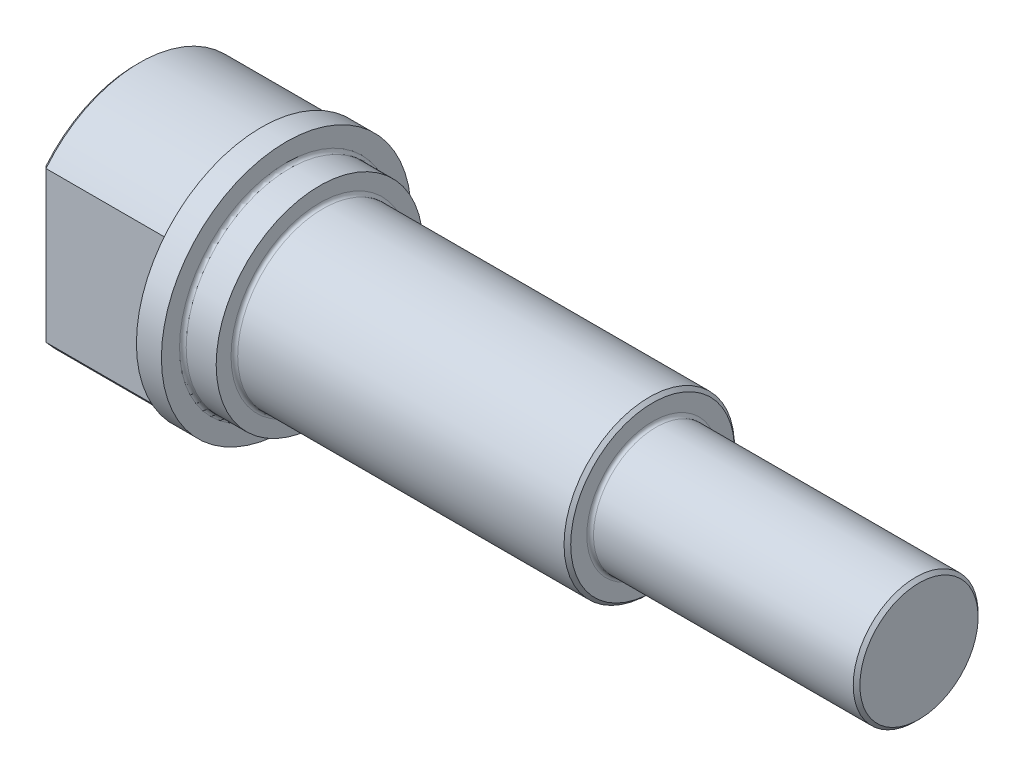
ISO-10303-21;
HEADER;
FILE_DESCRIPTION(('STEP AP214'),'2;1');
FILE_NAME('part.step','',(''),(''),'','','');
FILE_SCHEMA(('AUTOMOTIVE_DESIGN { 1 0 10303 214 1 1 1 1 }'));
ENDSEC;
DATA;
#1=APPLICATION_CONTEXT('core data for automotive mechanical design processes');
#2=APPLICATION_PROTOCOL_DEFINITION('international standard','automotive_design',2000,#1);
#3=PRODUCT_CONTEXT('',#1,'mechanical');
#4=PRODUCT('Part','Part','',(#3));
#5=PRODUCT_RELATED_PRODUCT_CATEGORY('part','',(#4));
#6=PRODUCT_DEFINITION_FORMATION('','',#4);
#7=PRODUCT_DEFINITION_CONTEXT('part definition',#1,'design');
#8=PRODUCT_DEFINITION('design','',#6,#7);
#9=PRODUCT_DEFINITION_SHAPE('','',#8);
#10=(LENGTH_UNIT() NAMED_UNIT(*) SI_UNIT(.MILLI.,.METRE.));
#11=(NAMED_UNIT(*) PLANE_ANGLE_UNIT() SI_UNIT($,.RADIAN.));
#12=(NAMED_UNIT(*) SI_UNIT($,.STERADIAN.) SOLID_ANGLE_UNIT());
#13=UNCERTAINTY_MEASURE_WITH_UNIT(LENGTH_MEASURE(1.E-05),#10,'distance_accuracy_value','');
#14=(GEOMETRIC_REPRESENTATION_CONTEXT(3) GLOBAL_UNCERTAINTY_ASSIGNED_CONTEXT((#13)) GLOBAL_UNIT_ASSIGNED_CONTEXT((#10,
#11,#12)) REPRESENTATION_CONTEXT('',''));
#15=CARTESIAN_POINT('',(0.,0.,0.));
#16=DIRECTION('',(0.,0.,1.));
#17=DIRECTION('',(1.,0.,0.));
#18=AXIS2_PLACEMENT_3D('',#15,#16,#17);
#19=CARTESIAN_POINT('',(0.,0.,0.));
#20=DIRECTION('',(-1.,0.,0.));
#21=DIRECTION('',(0.,0.,1.));
#22=AXIS2_PLACEMENT_3D('',#19,#20,#21);
#23=CYLINDRICAL_SURFACE('',#22,9.1694);
#24=DIRECTION('',(-1.,0.,0.));
#25=VECTOR('',#24,1.);
#26=CARTESIAN_POINT('',(21.1823340815986,5.74055453331819,7.1501));
#27=LINE('',#26,#25);
#28=CARTESIAN_POINT('',(9.271,5.74055453331819,7.1501));
#29=VERTEX_POINT('',#28);
#30=CARTESIAN_POINT('',(0.25399999999999,5.74055453331819,7.1501));
#31=VERTEX_POINT('',#30);
#32=EDGE_CURVE('E133',#29,#31,#27,.T.);
#33=ORIENTED_EDGE('',*,*,#32,.F.);
#34=CARTESIAN_POINT('',(9.271,0.,0.));
#35=DIRECTION('',(1.,0.,0.));
#36=DIRECTION('',(0.,0.,-1.));
#37=AXIS2_PLACEMENT_3D('',#34,#35,#36);
#38=CIRCLE('',#37,9.1694);
#39=CARTESIAN_POINT('',(9.271,5.74055453331819,-7.1501));
#40=VERTEX_POINT('',#39);
#41=EDGE_CURVE('E244',#29,#40,#38,.F.);
#42=ORIENTED_EDGE('',*,*,#41,.T.);
#43=DIRECTION('',(-1.,0.,0.));
#44=VECTOR('',#43,1.);
#45=CARTESIAN_POINT('',(21.1823340815986,5.74055453331819,-7.1501));
#46=LINE('',#45,#44);
#47=CARTESIAN_POINT('',(0.25399999999999,5.74055453331819,-7.1501));
#48=VERTEX_POINT('',#47);
#49=EDGE_CURVE('E220',#40,#48,#46,.T.);
#50=ORIENTED_EDGE('',*,*,#49,.T.);
#51=CARTESIAN_POINT('',(0.25399999999999,0.,0.));
#52=DIRECTION('',(1.,0.,0.));
#53=DIRECTION('',(0.,0.,-1.));
#54=AXIS2_PLACEMENT_3D('',#51,#52,#53);
#55=CIRCLE('',#54,9.1694);
#56=EDGE_CURVE('E165',#48,#31,#55,.T.);
#57=ORIENTED_EDGE('',*,*,#56,.T.);
#58=EDGE_LOOP('',(#33,#42,#50,#57));
#59=FACE_BOUND('',#58,.T.);
#60=ADVANCED_FACE('F48',(#59),#23,.T.);
#61=CARTESIAN_POINT('',(39.37,6.5,0.));
#62=DIRECTION('',(-1.,0.,0.));
#63=DIRECTION('',(0.,0.,1.));
#64=AXIS2_PLACEMENT_3D('',#61,#62,#63);
#65=PLANE('',#64);
#66=CARTESIAN_POINT('',(39.37,0.,0.));
#67=DIRECTION('',(-1.,0.,0.));
#68=DIRECTION('',(0.,0.,1.));
#69=AXIS2_PLACEMENT_3D('',#66,#67,#68);
#70=CIRCLE('',#69,5.0165);
#71=CARTESIAN_POINT('',(39.37,0.,5.0165));
#72=VERTEX_POINT('',#71);
#73=EDGE_CURVE('E237',#72,#72,#70,.T.);
#74=ORIENTED_EDGE('',*,*,#73,.T.);
#75=EDGE_LOOP('',(#74));
#76=FACE_BOUND('',#75,.T.);
#77=CARTESIAN_POINT('',(39.37,0.,0.));
#78=DIRECTION('',(-1.,0.,0.));
#79=DIRECTION('',(0.,0.,1.));
#80=AXIS2_PLACEMENT_3D('',#77,#78,#79);
#81=CIRCLE('',#80,6.24600000000001);
#82=CARTESIAN_POINT('',(39.37,0.,6.24600000000001));
#83=VERTEX_POINT('',#82);
#84=EDGE_CURVE('E171',#83,#83,#81,.F.);
#85=ORIENTED_EDGE('',*,*,#84,.T.);
#86=EDGE_LOOP('',(#85));
#87=FACE_BOUND('',#86,.T.);
#88=ADVANCED_FACE('F300',(#76,#87),#65,.F.);
#89=CARTESIAN_POINT('',(0.,0.,0.));
#90=DIRECTION('',(-1.,0.,0.));
#91=DIRECTION('',(0.,0.,1.));
#92=AXIS2_PLACEMENT_3D('',#89,#90,#91);
#93=CYLINDRICAL_SURFACE('',#92,6.5);
#94=CARTESIAN_POINT('',(14.224,0.,0.));
#95=DIRECTION('',(-1.,0.,0.));
#96=DIRECTION('',(0.,0.,1.));
#97=AXIS2_PLACEMENT_3D('',#94,#95,#96);
#98=CIRCLE('',#97,6.5);
#99=CARTESIAN_POINT('',(14.224,0.,6.5));
#100=VERTEX_POINT('',#99);
#101=EDGE_CURVE('E249',#100,#100,#98,.F.);
#102=ORIENTED_EDGE('',*,*,#101,.T.);
#103=EDGE_LOOP('',(#102));
#104=FACE_BOUND('',#103,.T.);
#105=CARTESIAN_POINT('',(39.116,0.,0.));
#106=DIRECTION('',(-1.,0.,0.));
#107=DIRECTION('',(0.,0.,1.));
#108=AXIS2_PLACEMENT_3D('',#105,#106,#107);
#109=CIRCLE('',#108,6.5);
#110=CARTESIAN_POINT('',(39.116,0.,6.5));
#111=VERTEX_POINT('',#110);
#112=EDGE_CURVE('E168',#111,#111,#109,.T.);
#113=ORIENTED_EDGE('',*,*,#112,.T.);
#114=EDGE_LOOP('',(#113));
#115=FACE_BOUND('',#114,.T.);
#116=ADVANCED_FACE('F307',(#104,#115),#93,.T.);
#117=CARTESIAN_POINT('',(13.97,7.8867,0.));
#118=DIRECTION('',(-1.,0.,0.));
#119=DIRECTION('',(0.,0.,1.));
#120=AXIS2_PLACEMENT_3D('',#117,#118,#119);
#121=PLANE('',#120);
#122=CARTESIAN_POINT('',(13.97,0.,0.));
#123=DIRECTION('',(-1.,0.,0.));
#124=DIRECTION('',(0.,0.,1.));
#125=AXIS2_PLACEMENT_3D('',#122,#123,#124);
#126=CIRCLE('',#125,6.754);
#127=CARTESIAN_POINT('',(13.97,0.,6.754));
#128=VERTEX_POINT('',#127);
#129=EDGE_CURVE('E246',#128,#128,#126,.T.);
#130=ORIENTED_EDGE('',*,*,#129,.T.);
#131=EDGE_LOOP('',(#130));
#132=FACE_BOUND('',#131,.T.);
#133=CARTESIAN_POINT('',(13.97,0.,0.));
#134=DIRECTION('',(-1.,0.,0.));
#135=DIRECTION('',(0.,0.,1.));
#136=AXIS2_PLACEMENT_3D('',#133,#134,#135);
#137=CIRCLE('',#136,7.8867);
#138=CARTESIAN_POINT('',(13.97,0.,7.8867));
#139=VERTEX_POINT('',#138);
#140=EDGE_CURVE('E144',#139,#139,#137,.T.);
#141=ORIENTED_EDGE('',*,*,#140,.F.);
#142=EDGE_LOOP('',(#141));
#143=FACE_BOUND('',#142,.T.);
#144=ADVANCED_FACE('F374',(#132,#143),#121,.F.);
#145=CARTESIAN_POINT('',(0.,0.,0.));
#146=DIRECTION('',(-1.,0.,0.));
#147=DIRECTION('',(0.,0.,1.));
#148=AXIS2_PLACEMENT_3D('',#145,#146,#147);
#149=CYLINDRICAL_SURFACE('',#148,7.8867);
#150=CARTESIAN_POINT('',(11.684,0.,0.));
#151=DIRECTION('',(-1.,0.,0.));
#152=DIRECTION('',(0.,0.,1.));
#153=AXIS2_PLACEMENT_3D('',#150,#151,#152);
#154=CIRCLE('',#153,7.8867);
#155=CARTESIAN_POINT('',(11.684,0.,7.8867));
#156=VERTEX_POINT('',#155);
#157=EDGE_CURVE('E13',#156,#156,#154,.F.);
#158=ORIENTED_EDGE('',*,*,#157,.T.);
#159=EDGE_LOOP('',(#158));
#160=FACE_BOUND('',#159,.T.);
#161=ORIENTED_EDGE('',*,*,#140,.T.);
#162=EDGE_LOOP('',(#161));
#163=FACE_BOUND('',#162,.T.);
#164=ADVANCED_FACE('F380',(#160,#163),#149,.T.);
#165=CARTESIAN_POINT('',(11.43,9.525,0.));
#166=DIRECTION('',(-1.,0.,0.));
#167=DIRECTION('',(0.,0.,1.));
#168=AXIS2_PLACEMENT_3D('',#165,#166,#167);
#169=PLANE('',#168);
#170=CARTESIAN_POINT('',(11.43,0.,0.));
#171=DIRECTION('',(-1.,0.,0.));
#172=DIRECTION('',(0.,0.,1.));
#173=AXIS2_PLACEMENT_3D('',#170,#171,#172);
#174=CIRCLE('',#173,8.1407);
#175=CARTESIAN_POINT('',(11.43,0.,8.1407));
#176=VERTEX_POINT('',#175);
#177=EDGE_CURVE('E62',#176,#176,#174,.T.);
#178=ORIENTED_EDGE('',*,*,#177,.T.);
#179=EDGE_LOOP('',(#178));
#180=FACE_BOUND('',#179,.T.);
#181=CARTESIAN_POINT('',(11.43,0.,0.));
#182=DIRECTION('',(-1.,0.,0.));
#183=DIRECTION('',(0.,0.,1.));
#184=AXIS2_PLACEMENT_3D('',#181,#182,#183);
#185=CIRCLE('',#184,9.525);
#186=CARTESIAN_POINT('',(11.43,0.,9.525));
#187=VERTEX_POINT('',#186);
#188=EDGE_CURVE('E136',#187,#187,#185,.T.);
#189=ORIENTED_EDGE('',*,*,#188,.F.);
#190=EDGE_LOOP('',(#189));
#191=FACE_BOUND('',#190,.T.);
#192=ADVANCED_FACE('F386',(#180,#191),#169,.F.);
#193=CARTESIAN_POINT('',(0.,0.,0.));
#194=DIRECTION('',(-1.,0.,0.));
#195=DIRECTION('',(0.,0.,1.));
#196=AXIS2_PLACEMENT_3D('',#193,#194,#195);
#197=CYLINDRICAL_SURFACE('',#196,9.525);
#198=CARTESIAN_POINT('',(9.525,0.,0.));
#199=DIRECTION('',(-1.,0.,0.));
#200=DIRECTION('',(0.,0.,1.));
#201=AXIS2_PLACEMENT_3D('',#198,#199,#200);
#202=CIRCLE('',#201,9.525);
#203=CARTESIAN_POINT('',(9.525,0.,9.525));
#204=VERTEX_POINT('',#203);
#205=EDGE_CURVE('E132',#204,#204,#202,.T.);
#206=ORIENTED_EDGE('',*,*,#205,.F.);
#207=EDGE_LOOP('',(#206));
#208=FACE_BOUND('',#207,.T.);
#209=ORIENTED_EDGE('',*,*,#188,.T.);
#210=EDGE_LOOP('',(#209));
#211=FACE_BOUND('',#210,.T.);
#212=ADVANCED_FACE('F318',(#208,#211),#197,.T.);
#213=CARTESIAN_POINT('',(9.525,9.1694,0.));
#214=DIRECTION('',(1.,0.,0.));
#215=DIRECTION('',(0.,0.,-1.));
#216=AXIS2_PLACEMENT_3D('',#213,#214,#215);
#217=PLANE('',#216);
#218=DIRECTION('',(0.,-1.,0.));
#219=VECTOR('',#218,1.);
#220=CARTESIAN_POINT('',(9.525,-5.74055453331819,7.4041));
#221=LINE('',#220,#219);
#222=CARTESIAN_POINT('',(9.525,5.82921699287306,7.4041));
#223=VERTEX_POINT('',#222);
#224=CARTESIAN_POINT('',(9.525,-5.82921699287306,7.4041));
#225=VERTEX_POINT('',#224);
#226=EDGE_CURVE('E226',#223,#225,#221,.T.);
#227=ORIENTED_EDGE('',*,*,#226,.T.);
#228=CARTESIAN_POINT('',(9.525,0.,0.));
#229=DIRECTION('',(1.,0.,0.));
#230=DIRECTION('',(0.,0.,-1.));
#231=AXIS2_PLACEMENT_3D('',#228,#229,#230);
#232=CIRCLE('',#231,9.4234);
#233=CARTESIAN_POINT('',(9.525,-5.82921699287306,-7.4041));
#234=VERTEX_POINT('',#233);
#235=EDGE_CURVE('E231',#225,#234,#232,.T.);
#236=ORIENTED_EDGE('',*,*,#235,.T.);
#237=DIRECTION('',(0.,1.,0.));
#238=VECTOR('',#237,1.);
#239=CARTESIAN_POINT('',(9.525,5.74055453331819,-7.4041));
#240=LINE('',#239,#238);
#241=CARTESIAN_POINT('',(9.525,5.82921699287306,-7.4041));
#242=VERTEX_POINT('',#241);
#243=EDGE_CURVE('E228',#234,#242,#240,.T.);
#244=ORIENTED_EDGE('',*,*,#243,.T.);
#245=CARTESIAN_POINT('',(9.525,0.,0.));
#246=DIRECTION('',(1.,0.,0.));
#247=DIRECTION('',(0.,0.,-1.));
#248=AXIS2_PLACEMENT_3D('',#245,#246,#247);
#249=CIRCLE('',#248,9.4234);
#250=EDGE_CURVE('E180',#242,#223,#249,.T.);
#251=ORIENTED_EDGE('',*,*,#250,.T.);
#252=EDGE_LOOP('',(#227,#236,#244,#251));
#253=FACE_BOUND('',#252,.T.);
#254=ORIENTED_EDGE('',*,*,#205,.T.);
#255=EDGE_LOOP('',(#254));
#256=FACE_BOUND('',#255,.T.);
#257=ADVANCED_FACE('F312',(#253,#256),#217,.F.);
#258=DIRECTION('',(-1.,0.,0.));
#259=VECTOR('',#258,1.);
#260=CARTESIAN_POINT('',(21.1823340815986,-5.74055453331819,-7.1501));
#261=LINE('',#260,#259);
#262=CARTESIAN_POINT('',(9.271,-5.74055453331819,-7.1501));
#263=VERTEX_POINT('',#262);
#264=CARTESIAN_POINT('',(0.25399999999999,-5.74055453331819,-7.1501));
#265=VERTEX_POINT('',#264);
#266=EDGE_CURVE('E320',#263,#265,#261,.T.);
#267=ORIENTED_EDGE('',*,*,#266,.F.);
#268=CARTESIAN_POINT('',(9.271,0.,0.));
#269=DIRECTION('',(1.,0.,0.));
#270=DIRECTION('',(0.,0.,-1.));
#271=AXIS2_PLACEMENT_3D('',#268,#269,#270);
#272=CIRCLE('',#271,9.1694);
#273=CARTESIAN_POINT('',(9.271,-5.74055453331819,7.1501));
#274=VERTEX_POINT('',#273);
#275=EDGE_CURVE('E70',#263,#274,#272,.F.);
#276=ORIENTED_EDGE('',*,*,#275,.T.);
#277=DIRECTION('',(-1.,0.,0.));
#278=VECTOR('',#277,1.);
#279=CARTESIAN_POINT('',(21.1823340815986,-5.74055453331819,7.1501));
#280=LINE('',#279,#278);
#281=CARTESIAN_POINT('',(0.25399999999999,-5.74055453331819,7.1501));
#282=VERTEX_POINT('',#281);
#283=EDGE_CURVE('E138',#274,#282,#280,.T.);
#284=ORIENTED_EDGE('',*,*,#283,.T.);
#285=CARTESIAN_POINT('',(0.25399999999999,0.,0.));
#286=DIRECTION('',(1.,0.,0.));
#287=DIRECTION('',(0.,0.,-1.));
#288=AXIS2_PLACEMENT_3D('',#285,#286,#287);
#289=CIRCLE('',#288,9.1694);
#290=EDGE_CURVE('E159',#282,#265,#289,.T.);
#291=ORIENTED_EDGE('',*,*,#290,.T.);
#292=EDGE_LOOP('',(#267,#276,#284,#291));
#293=FACE_BOUND('',#292,.T.);
#294=ADVANCED_FACE('F303',(#293),#23,.T.);
#295=CARTESIAN_POINT('',(0.,1.09985226280624,0.));
#296=DIRECTION('',(1.,0.,0.));
#297=DIRECTION('',(0.,0.,-1.));
#298=AXIS2_PLACEMENT_3D('',#295,#296,#297);
#299=PLANE('',#298);
#300=CARTESIAN_POINT('',(0.,0.,0.));
#301=DIRECTION('',(1.,0.,0.));
#302=DIRECTION('',(0.,0.,-1.));
#303=AXIS2_PLACEMENT_3D('',#300,#301,#302);
#304=CIRCLE('',#303,8.91540000000001);
#305=CARTESIAN_POINT('',(0.,5.65050103530652,6.89610000000001));
#306=VERTEX_POINT('',#305);
#307=CARTESIAN_POINT('',(0.,5.65050103530652,-6.89610000000001));
#308=VERTEX_POINT('',#307);
#309=EDGE_CURVE('E150',#306,#308,#304,.F.);
#310=ORIENTED_EDGE('',*,*,#309,.T.);
#311=DIRECTION('',(0.,-1.,0.));
#312=VECTOR('',#311,1.);
#313=CARTESIAN_POINT('',(0.,1.09985226280624,-6.89610000000001));
#314=LINE('',#313,#312);
#315=CARTESIAN_POINT('',(0.,-5.65050103530652,-6.89610000000001));
#316=VERTEX_POINT('',#315);
#317=EDGE_CURVE('E156',#308,#316,#314,.T.);
#318=ORIENTED_EDGE('',*,*,#317,.T.);
#319=CARTESIAN_POINT('',(0.,0.,0.));
#320=DIRECTION('',(1.,0.,0.));
#321=DIRECTION('',(0.,0.,-1.));
#322=AXIS2_PLACEMENT_3D('',#319,#320,#321);
#323=CIRCLE('',#322,8.91540000000001);
#324=CARTESIAN_POINT('',(0.,-5.65050103530652,6.89610000000001));
#325=VERTEX_POINT('',#324);
#326=EDGE_CURVE('E154',#316,#325,#323,.F.);
#327=ORIENTED_EDGE('',*,*,#326,.T.);
#328=DIRECTION('',(0.,1.,0.));
#329=VECTOR('',#328,1.);
#330=CARTESIAN_POINT('',(0.,1.09985226280624,6.89610000000001));
#331=LINE('',#330,#329);
#332=EDGE_CURVE('E152',#325,#306,#331,.T.);
#333=ORIENTED_EDGE('',*,*,#332,.T.);
#334=EDGE_LOOP('',(#310,#318,#327,#333));
#335=FACE_BOUND('',#334,.T.);
#336=CARTESIAN_POINT('',(0.,0.,0.));
#337=DIRECTION('',(-1.,0.,0.));
#338=DIRECTION('',(0.,0.,1.));
#339=AXIS2_PLACEMENT_3D('',#336,#337,#338);
#340=CIRCLE('',#339,1.09985226280624);
#341=CARTESIAN_POINT('',(0.,0.,1.09985226280624));
#342=VERTEX_POINT('',#341);
#343=EDGE_CURVE('E130',#342,#342,#340,.T.);
#344=ORIENTED_EDGE('',*,*,#343,.F.);
#345=EDGE_LOOP('',(#344));
#346=FACE_BOUND('',#345,.T.);
#347=ADVANCED_FACE('F126',(#335,#346),#299,.F.);
#348=CARTESIAN_POINT('',(0.,0.,0.));
#349=DIRECTION('',(-1.,0.,0.));
#350=DIRECTION('',(0.,0.,1.));
#351=AXIS2_PLACEMENT_3D('',#348,#349,#350);
#352=CONICAL_SURFACE('',#351,1.09985226280624,1.0471975511966);
#353=CARTESIAN_POINT('',(0.635,0.,0.));
#354=VERTEX_POINT('',#353);
#355=VERTEX_LOOP('',#354);
#356=FACE_BOUND('',#355,.T.);
#357=ORIENTED_EDGE('',*,*,#343,.T.);
#358=EDGE_LOOP('',(#357));
#359=FACE_BOUND('',#358,.T.);
#360=ADVANCED_FACE('F122',(#356,#359),#352,.F.);
#361=CARTESIAN_POINT('',(59.69,4.7625,0.));
#362=DIRECTION('',(-1.,0.,0.));
#363=DIRECTION('',(0.,0.,1.));
#364=AXIS2_PLACEMENT_3D('',#361,#362,#363);
#365=PLANE('',#364);
#366=CARTESIAN_POINT('',(59.69,0.,0.));
#367=DIRECTION('',(-1.,0.,0.));
#368=DIRECTION('',(0.,0.,1.));
#369=AXIS2_PLACEMENT_3D('',#366,#367,#368);
#370=CIRCLE('',#369,4.50850000000001);
#371=CARTESIAN_POINT('',(59.69,0.,4.50850000000001));
#372=VERTEX_POINT('',#371);
#373=EDGE_CURVE('E177',#372,#372,#370,.F.);
#374=ORIENTED_EDGE('',*,*,#373,.T.);
#375=EDGE_LOOP('',(#374));
#376=FACE_BOUND('',#375,.T.);
#377=ADVANCED_FACE('F125',(#376),#365,.F.);
#378=CARTESIAN_POINT('',(0.,0.,0.));
#379=DIRECTION('',(-1.,0.,0.));
#380=DIRECTION('',(0.,0.,1.));
#381=AXIS2_PLACEMENT_3D('',#378,#379,#380);
#382=CYLINDRICAL_SURFACE('',#381,4.7625);
#383=CARTESIAN_POINT('',(39.624,0.,0.));
#384=DIRECTION('',(-1.,0.,0.));
#385=DIRECTION('',(0.,0.,1.));
#386=AXIS2_PLACEMENT_3D('',#383,#384,#385);
#387=CIRCLE('',#386,4.7625);
#388=CARTESIAN_POINT('',(39.624,0.,4.7625));
#389=VERTEX_POINT('',#388);
#390=EDGE_CURVE('E240',#389,#389,#387,.F.);
#391=ORIENTED_EDGE('',*,*,#390,.T.);
#392=EDGE_LOOP('',(#391));
#393=FACE_BOUND('',#392,.T.);
#394=CARTESIAN_POINT('',(59.436,0.,0.));
#395=DIRECTION('',(-1.,0.,0.));
#396=DIRECTION('',(0.,0.,1.));
#397=AXIS2_PLACEMENT_3D('',#394,#395,#396);
#398=CIRCLE('',#397,4.7625);
#399=CARTESIAN_POINT('',(59.436,0.,4.7625));
#400=VERTEX_POINT('',#399);
#401=EDGE_CURVE('E174',#400,#400,#398,.T.);
#402=ORIENTED_EDGE('',*,*,#401,.T.);
#403=EDGE_LOOP('',(#402));
#404=FACE_BOUND('',#403,.T.);
#405=ADVANCED_FACE('F347',(#393,#404),#382,.T.);
#406=CARTESIAN_POINT('',(21.1823340815986,-5.74055453331819,7.1501));
#407=DIRECTION('',(0.,0.,-1.));
#408=DIRECTION('',(-1.,0.,0.));
#409=AXIS2_PLACEMENT_3D('',#406,#407,#408);
#410=PLANE('',#409);
#411=ORIENTED_EDGE('',*,*,#283,.F.);
#412=DIRECTION('',(0.,-1.,0.));
#413=VECTOR('',#412,1.);
#414=CARTESIAN_POINT('',(9.271,5.74055453331819,7.1501));
#415=LINE('',#414,#413);
#416=EDGE_CURVE('E77',#274,#29,#415,.F.);
#417=ORIENTED_EDGE('',*,*,#416,.T.);
#418=ORIENTED_EDGE('',*,*,#32,.T.);
#419=DIRECTION('',(0.,-1.,0.));
#420=VECTOR('',#419,1.);
#421=CARTESIAN_POINT('',(0.25399999999999,-5.74055453331819,7.1501));
#422=LINE('',#421,#420);
#423=EDGE_CURVE('E162',#31,#282,#422,.T.);
#424=ORIENTED_EDGE('',*,*,#423,.T.);
#425=EDGE_LOOP('',(#411,#417,#418,#424));
#426=FACE_BOUND('',#425,.T.);
#427=ADVANCED_FACE('F340',(#426),#410,.F.);
#428=CARTESIAN_POINT('',(21.1823340815986,-5.74055453331819,-7.1501));
#429=DIRECTION('',(0.,0.,1.));
#430=DIRECTION('',(1.,0.,0.));
#431=AXIS2_PLACEMENT_3D('',#428,#429,#430);
#432=PLANE('',#431);
#433=ORIENTED_EDGE('',*,*,#49,.F.);
#434=DIRECTION('',(0.,1.,0.));
#435=VECTOR('',#434,1.);
#436=CARTESIAN_POINT('',(9.271,-5.74055453331819,-7.1501));
#437=LINE('',#436,#435);
#438=EDGE_CURVE('E233',#40,#263,#437,.F.);
#439=ORIENTED_EDGE('',*,*,#438,.T.);
#440=ORIENTED_EDGE('',*,*,#266,.T.);
#441=DIRECTION('',(0.,1.,0.));
#442=VECTOR('',#441,1.);
#443=CARTESIAN_POINT('',(0.25399999999999,-5.74055453331819,-7.1501));
#444=LINE('',#443,#442);
#445=EDGE_CURVE('E147',#265,#48,#444,.T.);
#446=ORIENTED_EDGE('',*,*,#445,.T.);
#447=EDGE_LOOP('',(#433,#439,#440,#446));
#448=FACE_BOUND('',#447,.T.);
#449=ADVANCED_FACE('F338',(#448),#432,.F.);
#450=CARTESIAN_POINT('',(0.25399999999999,-5.74055453331819,7.1501));
#451=DIRECTION('',(0.707106781186545,0.,-0.70710678118655));
#452=DIRECTION('',(-0.70710678118655,0.,-0.707106781186545));
#453=AXIS2_PLACEMENT_3D('',#450,#451,#452);
#454=PLANE('',#453);
#455=CARTESIAN_POINT('',(0.,5.65050103530652,6.89610000000001));
#456=CARTESIAN_POINT('',(0.0423135436730869,5.66562159002006,6.9384135436731));
#457=CARTESIAN_POINT('',(0.0846369824348502,5.68068632563542,6.98073698243486));
#458=CARTESIAN_POINT('',(0.169303649101997,5.71070415830325,7.06540364910201));
#459=CARTESIAN_POINT('',(0.211646877006897,5.72565725535845,7.10774687700691));
#460=CARTESIAN_POINT('',(0.25399999999999,5.74055453331819,7.1501));
#461=B_SPLINE_CURVE_WITH_KNOTS('',3,(#455,#456,#457,#458,#459,#460),.UNSPECIFIED.,.F.,.F.,(4,2,
4),(0.,0.185163275969124,0.370326547416767),.UNSPECIFIED.);
#462=EDGE_CURVE('E221',#306,#31,#461,.T.);
#463=ORIENTED_EDGE('',*,*,#462,.F.);
#464=ORIENTED_EDGE('',*,*,#332,.F.);
#465=CARTESIAN_POINT('',(0.,-5.65050103530652,6.89610000000001));
#466=CARTESIAN_POINT('',(0.0423135436730869,-5.66562159002006,6.9384135436731));
#467=CARTESIAN_POINT('',(0.0846369824348502,-5.68068632563542,6.98073698243486));
#468=CARTESIAN_POINT('',(0.169303649101997,-5.71070415830325,7.06540364910201));
#469=CARTESIAN_POINT('',(0.211646877006897,-5.72565725535845,7.10774687700691));
#470=CARTESIAN_POINT('',(0.25399999999999,-5.74055453331819,7.1501));
#471=B_SPLINE_CURVE_WITH_KNOTS('',3,(#465,#466,#467,#468,#469,#470),.UNSPECIFIED.,.F.,.F.,(4,2,
4),(0.,0.185163275969124,0.370326547416767),.UNSPECIFIED.);
#472=EDGE_CURVE('E214',#282,#325,#471,.F.);
#473=ORIENTED_EDGE('',*,*,#472,.F.);
#474=ORIENTED_EDGE('',*,*,#423,.F.);
#475=EDGE_LOOP('',(#463,#464,#473,#474));
#476=FACE_BOUND('',#475,.T.);
#477=ADVANCED_FACE('F208',(#476),#454,.F.);
#478=CARTESIAN_POINT('',(0.,0.,0.));
#479=DIRECTION('',(1.,0.,0.));
#480=DIRECTION('',(0.,0.,-1.));
#481=AXIS2_PLACEMENT_3D('',#478,#479,#480);
#482=CONICAL_SURFACE('',#481,8.91540000000001,0.785398163397445);
#483=ORIENTED_EDGE('',*,*,#472,.T.);
#484=ORIENTED_EDGE('',*,*,#326,.F.);
#485=CARTESIAN_POINT('',(0.,-5.65050103530652,-6.89610000000001));
#486=CARTESIAN_POINT('',(0.0423135436730869,-5.66562159002006,-6.9384135436731));
#487=CARTESIAN_POINT('',(0.0846369824348502,-5.68068632563542,-6.98073698243486));
#488=CARTESIAN_POINT('',(0.169303649101997,-5.71070415830325,-7.06540364910201));
#489=CARTESIAN_POINT('',(0.211646877006897,-5.72565725535845,-7.10774687700691));
#490=CARTESIAN_POINT('',(0.25399999999999,-5.74055453331819,-7.1501));
#491=B_SPLINE_CURVE_WITH_KNOTS('',3,(#485,#486,#487,#488,#489,#490),.UNSPECIFIED.,.F.,.F.,(4,2,
4),(0.,0.185163275969124,0.370326547416767),.UNSPECIFIED.);
#492=EDGE_CURVE('E189',#265,#316,#491,.F.);
#493=ORIENTED_EDGE('',*,*,#492,.F.);
#494=ORIENTED_EDGE('',*,*,#290,.F.);
#495=EDGE_LOOP('',(#483,#484,#493,#494));
#496=FACE_BOUND('',#495,.T.);
#497=ADVANCED_FACE('F203',(#496),#482,.T.);
#498=CARTESIAN_POINT('',(0.,0.,0.));
#499=DIRECTION('',(1.,0.,0.));
#500=DIRECTION('',(0.,0.,-1.));
#501=AXIS2_PLACEMENT_3D('',#498,#499,#500);
#502=CONICAL_SURFACE('',#501,8.91540000000001,0.785398163397445);
#503=ORIENTED_EDGE('',*,*,#462,.T.);
#504=ORIENTED_EDGE('',*,*,#56,.F.);
#505=CARTESIAN_POINT('',(0.25399999999999,5.74055453331819,-7.1501));
#506=CARTESIAN_POINT('',(0.211646877006897,5.72565725535845,-7.10774687700691));
#507=CARTESIAN_POINT('',(0.169303649101997,5.71070415830325,-7.06540364910201));
#508=CARTESIAN_POINT('',(0.0846369824348503,5.68068632563542,-6.98073698243486));
#509=CARTESIAN_POINT('',(0.0423135436730871,5.66562159002006,-6.9384135436731));
#510=CARTESIAN_POINT('',(0.,5.65050103530652,-6.89610000000001));
#511=B_SPLINE_CURVE_WITH_KNOTS('',3,(#505,#506,#507,#508,#509,#510),.UNSPECIFIED.,.F.,.F.,(4,2,
4),(0.,0.185163271447644,0.370326547416768),.UNSPECIFIED.);
#512=EDGE_CURVE('E181',#308,#48,#511,.F.);
#513=ORIENTED_EDGE('',*,*,#512,.F.);
#514=ORIENTED_EDGE('',*,*,#309,.F.);
#515=EDGE_LOOP('',(#503,#504,#513,#514));
#516=FACE_BOUND('',#515,.T.);
#517=ADVANCED_FACE('F195',(#516),#502,.T.);
#518=CARTESIAN_POINT('',(0.25399999999999,-5.74055453331819,-7.1501));
#519=DIRECTION('',(0.707106781186545,0.,0.70710678118655));
#520=DIRECTION('',(0.70710678118655,0.,-0.707106781186545));
#521=AXIS2_PLACEMENT_3D('',#518,#519,#520);
#522=PLANE('',#521);
#523=ORIENTED_EDGE('',*,*,#492,.T.);
#524=ORIENTED_EDGE('',*,*,#317,.F.);
#525=ORIENTED_EDGE('',*,*,#512,.T.);
#526=ORIENTED_EDGE('',*,*,#445,.F.);
#527=EDGE_LOOP('',(#523,#524,#525,#526));
#528=FACE_BOUND('',#527,.T.);
#529=ADVANCED_FACE('F198',(#528),#522,.F.);
#530=CARTESIAN_POINT('',(39.116,0.,0.));
#531=DIRECTION('',(-1.,0.,0.));
#532=DIRECTION('',(0.,0.,1.));
#533=AXIS2_PLACEMENT_3D('',#530,#531,#532);
#534=CONICAL_SURFACE('',#533,6.5,0.78539816339745);
#535=ORIENTED_EDGE('',*,*,#84,.F.);
#536=EDGE_LOOP('',(#535));
#537=FACE_BOUND('',#536,.T.);
#538=ORIENTED_EDGE('',*,*,#112,.F.);
#539=EDGE_LOOP('',(#538));
#540=FACE_BOUND('',#539,.T.);
#541=ADVANCED_FACE('F201',(#537,#540),#534,.T.);
#542=CARTESIAN_POINT('',(59.436,0.,0.));
#543=DIRECTION('',(-1.,0.,0.));
#544=DIRECTION('',(0.,0.,1.));
#545=AXIS2_PLACEMENT_3D('',#542,#543,#544);
#546=CONICAL_SURFACE('',#545,4.7625,0.785398163397443);
#547=ORIENTED_EDGE('',*,*,#373,.F.);
#548=EDGE_LOOP('',(#547));
#549=FACE_BOUND('',#548,.T.);
#550=ORIENTED_EDGE('',*,*,#401,.F.);
#551=EDGE_LOOP('',(#550));
#552=FACE_BOUND('',#551,.T.);
#553=ADVANCED_FACE('F284',(#549,#552),#546,.T.);
#554=CARTESIAN_POINT('',(9.271,9.1694,7.4041));
#555=DIRECTION('',(0.,1.,0.));
#556=DIRECTION('',(0.,0.,1.));
#557=AXIS2_PLACEMENT_3D('',#554,#555,#556);
#558=CYLINDRICAL_SURFACE('',#557,0.254);
#559=CARTESIAN_POINT('',(9.271,5.74055453331819,7.1501));
#560=CARTESIAN_POINT('',(9.284708936972,5.74054927339734,7.15008548509316));
#561=CARTESIAN_POINT('',(9.298409457052,5.74094458714899,7.15120886533982));
#562=CARTESIAN_POINT('',(9.32538231777116,5.74249562916968,7.15561890175897));
#563=CARTESIAN_POINT('',(9.3386555726678,5.74364960238437,7.15890056504699));
#564=CARTESIAN_POINT('',(9.3644281401139,5.74667743714398,7.16751521211465));
#565=CARTESIAN_POINT('',(9.3769275198536,5.74855123608932,7.17284801751696));
#566=CARTESIAN_POINT('',(9.40083217432803,5.75294911095694,7.18537268675389));
#567=CARTESIAN_POINT('',(9.41223720008352,5.75547333437979,7.19256497227495));
#568=CARTESIAN_POINT('',(9.43393898548065,5.76115529172168,7.20876778519907));
#569=CARTESIAN_POINT('',(9.44420266484451,5.76432674887655,7.21781772984308));
#570=CARTESIAN_POINT('',(9.46307597650988,5.77116318749824,7.23734471657495));
#571=CARTESIAN_POINT('',(9.47168501577286,5.77482834511442,7.24782226803978));
#572=CARTESIAN_POINT('',(9.48749328429163,5.78275422160322,7.27050398185379));
#573=CARTESIAN_POINT('',(9.49459199487891,5.78703635173193,7.28277064560859));
#574=CARTESIAN_POINT('',(9.50662820498362,5.79590898988969,7.30821791812703));
#575=CARTESIAN_POINT('',(9.51156577722397,5.80049948753609,7.3213984961199));
#576=CARTESIAN_POINT('',(9.51840299550717,5.80889209948176,7.34552595136915));
#577=CARTESIAN_POINT('',(9.52072030739635,5.81266027836448,7.35636917652709));
#578=CARTESIAN_POINT('',(9.52391990855371,5.82025032344644,7.3782318126208));
#579=CARTESIAN_POINT('',(9.52480480067033,5.82407207951055,7.3892508671653));
#580=CARTESIAN_POINT('',(9.52499039907889,5.82833259407881,7.40154710485919));
#581=CARTESIAN_POINT('',(9.52500002454279,5.82877484342786,7.40282362330847));
#582=CARTESIAN_POINT('',(9.525,5.82921699287306,7.4041));
#583=B_SPLINE_CURVE_WITH_KNOTS('',3,(#559,#560,#561,#562,#563,#564,#565,#566,#567,#568,#569,
#570,#571,#572,#573,#574,#575,#576,#577,#578,#579,#580,#581,#582),.UNSPECIFIED.,.F.,.F.,(4,2,2,
2,2,2,2,2,2,2,2,4),(0.,0.0410622223659508,0.0820297856119083,0.122993786923484,
0.163967086069407,0.205921580652359,0.247891084193173,0.29211409964015,0.336335626855966,
0.371386125850385,0.406372862834762,0.410425675915286),.UNSPECIFIED.);
#584=EDGE_CURVE('E275',#29,#223,#583,.T.);
#585=ORIENTED_EDGE('',*,*,#584,.F.);
#586=ORIENTED_EDGE('',*,*,#416,.F.);
#587=CARTESIAN_POINT('',(9.271,-5.74055453331819,7.1501));
#588=CARTESIAN_POINT('',(9.284708936972,-5.74054927339734,7.15008548509316));
#589=CARTESIAN_POINT('',(9.298409457052,-5.74094458714899,7.15120886533982));
#590=CARTESIAN_POINT('',(9.32538231777116,-5.74249562916968,7.15561890175897));
#591=CARTESIAN_POINT('',(9.3386555726678,-5.74364960238437,7.15890056504699));
#592=CARTESIAN_POINT('',(9.3644281401139,-5.74667743714398,7.16751521211465));
#593=CARTESIAN_POINT('',(9.3769275198536,-5.74855123608932,7.17284801751696));
#594=CARTESIAN_POINT('',(9.40083217432803,-5.75294911095694,7.18537268675389));
#595=CARTESIAN_POINT('',(9.41223720008352,-5.75547333437979,7.19256497227495));
#596=CARTESIAN_POINT('',(9.43393898548065,-5.76115529172168,7.20876778519907));
#597=CARTESIAN_POINT('',(9.44420266484451,-5.76432674887655,7.21781772984308));
#598=CARTESIAN_POINT('',(9.46307597650988,-5.77116318749824,7.23734471657495));
#599=CARTESIAN_POINT('',(9.47168501577286,-5.77482834511442,7.24782226803978));
#600=CARTESIAN_POINT('',(9.48749328429163,-5.78275422160322,7.27050398185379));
#601=CARTESIAN_POINT('',(9.49459199487891,-5.78703635173193,7.28277064560859));
#602=CARTESIAN_POINT('',(9.50662820498362,-5.79590898988969,7.30821791812703));
#603=CARTESIAN_POINT('',(9.51156577722397,-5.80049948753609,7.3213984961199));
#604=CARTESIAN_POINT('',(9.51840299550717,-5.80889209948176,7.34552595136915));
#605=CARTESIAN_POINT('',(9.52072030739635,-5.81266027836448,7.35636917652709));
#606=CARTESIAN_POINT('',(9.52391990855371,-5.82025032344644,7.3782318126208));
#607=CARTESIAN_POINT('',(9.52480480067033,-5.82407207951055,7.3892508671653));
#608=CARTESIAN_POINT('',(9.52499039907889,-5.82833259407881,7.40154710485919));
#609=CARTESIAN_POINT('',(9.52500002454279,-5.82877484342786,7.40282362330847));
#610=CARTESIAN_POINT('',(9.525,-5.82921699287306,7.4041));
#611=B_SPLINE_CURVE_WITH_KNOTS('',3,(#587,#588,#589,#590,#591,#592,#593,#594,#595,#596,#597,
#598,#599,#600,#601,#602,#603,#604,#605,#606,#607,#608,#609,#610),.UNSPECIFIED.,.F.,.F.,(4,2,2,
2,2,2,2,2,2,2,2,4),(0.,0.0410622223659508,0.0820297856119083,0.122993786923484,
0.163967086069407,0.205921580652359,0.247891084193173,0.29211409964015,0.336335626855966,
0.371386125850385,0.406372862834762,0.410425675915286),.UNSPECIFIED.);
#612=EDGE_CURVE('E52',#225,#274,#611,.F.);
#613=ORIENTED_EDGE('',*,*,#612,.F.);
#614=ORIENTED_EDGE('',*,*,#226,.F.);
#615=EDGE_LOOP('',(#585,#586,#613,#614));
#616=FACE_BOUND('',#615,.T.);
#617=ADVANCED_FACE('F280',(#616),#558,.F.);
#618=CARTESIAN_POINT('',(9.271,0.,0.));
#619=DIRECTION('',(1.,0.,0.));
#620=DIRECTION('',(0.,0.,-1.));
#621=AXIS2_PLACEMENT_3D('',#618,#619,#620);
#622=TOROIDAL_SURFACE('',#621,9.4234,0.254);
#623=ORIENTED_EDGE('',*,*,#612,.T.);
#624=ORIENTED_EDGE('',*,*,#275,.F.);
#625=CARTESIAN_POINT('',(9.271,-5.74055453331819,-7.1501));
#626=CARTESIAN_POINT('',(9.284708936972,-5.74054927339734,-7.15008548509316));
#627=CARTESIAN_POINT('',(9.298409457052,-5.74094458714899,-7.15120886533982));
#628=CARTESIAN_POINT('',(9.32538231777116,-5.74249562916968,-7.15561890175897));
#629=CARTESIAN_POINT('',(9.3386555726678,-5.74364960238437,-7.15890056504699));
#630=CARTESIAN_POINT('',(9.3644281401139,-5.74667743714398,-7.16751521211465));
#631=CARTESIAN_POINT('',(9.3769275198536,-5.74855123608932,-7.17284801751696));
#632=CARTESIAN_POINT('',(9.40083217432803,-5.75294911095694,-7.18537268675389));
#633=CARTESIAN_POINT('',(9.41223720008352,-5.75547333437979,-7.19256497227495));
#634=CARTESIAN_POINT('',(9.43393898548065,-5.76115529172168,-7.20876778519907));
#635=CARTESIAN_POINT('',(9.44420266484451,-5.76432674887655,-7.21781772984308));
#636=CARTESIAN_POINT('',(9.46307597650988,-5.77116318749824,-7.23734471657495));
#637=CARTESIAN_POINT('',(9.47168501577286,-5.77482834511442,-7.24782226803978));
#638=CARTESIAN_POINT('',(9.48749328429163,-5.78275422160322,-7.27050398185379));
#639=CARTESIAN_POINT('',(9.49459199487891,-5.78703635173193,-7.28277064560859));
#640=CARTESIAN_POINT('',(9.50662820498362,-5.79590898988969,-7.30821791812703));
#641=CARTESIAN_POINT('',(9.51156577722397,-5.80049948753609,-7.3213984961199));
#642=CARTESIAN_POINT('',(9.51840299550717,-5.80889209948176,-7.34552595136915));
#643=CARTESIAN_POINT('',(9.52072030739635,-5.81266027836448,-7.35636917652709));
#644=CARTESIAN_POINT('',(9.52391990855371,-5.82025032344644,-7.3782318126208));
#645=CARTESIAN_POINT('',(9.52480480067033,-5.82407207951055,-7.3892508671653));
#646=CARTESIAN_POINT('',(9.52499039907889,-5.82833259407881,-7.40154710485919));
#647=CARTESIAN_POINT('',(9.52500002454279,-5.82877484342786,-7.40282362330847));
#648=CARTESIAN_POINT('',(9.525,-5.82921699287306,-7.4041));
#649=B_SPLINE_CURVE_WITH_KNOTS('',3,(#625,#626,#627,#628,#629,#630,#631,#632,#633,#634,#635,
#636,#637,#638,#639,#640,#641,#642,#643,#644,#645,#646,#647,#648),.UNSPECIFIED.,.F.,.F.,(4,2,2,
2,2,2,2,2,2,2,2,4),(0.,0.0410622223659508,0.0820297856119083,0.122993786923484,
0.163967086069407,0.205921580652359,0.247891084193173,0.29211409964015,0.336335626855966,
0.371386125850385,0.406372862834762,0.410425675915286),.UNSPECIFIED.);
#650=EDGE_CURVE('E261',#234,#263,#649,.F.);
#651=ORIENTED_EDGE('',*,*,#650,.F.);
#652=ORIENTED_EDGE('',*,*,#235,.F.);
#653=EDGE_LOOP('',(#623,#624,#651,#652));
#654=FACE_BOUND('',#653,.T.);
#655=ADVANCED_FACE('F271',(#654),#622,.F.);
#656=CARTESIAN_POINT('',(9.271,0.,0.));
#657=DIRECTION('',(1.,0.,0.));
#658=DIRECTION('',(0.,0.,-1.));
#659=AXIS2_PLACEMENT_3D('',#656,#657,#658);
#660=TOROIDAL_SURFACE('',#659,9.4234,0.254);
#661=ORIENTED_EDGE('',*,*,#584,.T.);
#662=ORIENTED_EDGE('',*,*,#250,.F.);
#663=CARTESIAN_POINT('',(9.271,5.74055453331819,-7.1501));
#664=CARTESIAN_POINT('',(9.284708936972,5.74054927339734,-7.15008548509316));
#665=CARTESIAN_POINT('',(9.298409457052,5.74094458714899,-7.15120886533982));
#666=CARTESIAN_POINT('',(9.32538231777116,5.74249562916968,-7.15561890175897));
#667=CARTESIAN_POINT('',(9.3386555726678,5.74364960238437,-7.15890056504699));
#668=CARTESIAN_POINT('',(9.3644281401139,5.74667743714398,-7.16751521211465));
#669=CARTESIAN_POINT('',(9.3769275198536,5.74855123608932,-7.17284801751696));
#670=CARTESIAN_POINT('',(9.40083217432803,5.75294911095694,-7.18537268675389));
#671=CARTESIAN_POINT('',(9.41223720008352,5.75547333437979,-7.19256497227495));
#672=CARTESIAN_POINT('',(9.43393898548065,5.76115529172168,-7.20876778519907));
#673=CARTESIAN_POINT('',(9.44420266484451,5.76432674887655,-7.21781772984308));
#674=CARTESIAN_POINT('',(9.46307597650988,5.77116318749824,-7.23734471657495));
#675=CARTESIAN_POINT('',(9.47168501577286,5.77482834511442,-7.24782226803978));
#676=CARTESIAN_POINT('',(9.48749328429163,5.78275422160322,-7.27050398185379));
#677=CARTESIAN_POINT('',(9.49459199487891,5.78703635173193,-7.28277064560859));
#678=CARTESIAN_POINT('',(9.50662820498362,5.79590898988969,-7.30821791812703));
#679=CARTESIAN_POINT('',(9.51156577722397,5.80049948753609,-7.3213984961199));
#680=CARTESIAN_POINT('',(9.51840299550717,5.80889209948176,-7.34552595136915));
#681=CARTESIAN_POINT('',(9.52072030739635,5.81266027836448,-7.35636917652709));
#682=CARTESIAN_POINT('',(9.52391990855371,5.82025032344644,-7.3782318126208));
#683=CARTESIAN_POINT('',(9.52480480067033,5.82407207951055,-7.3892508671653));
#684=CARTESIAN_POINT('',(9.52499039907889,5.82833259407881,-7.40154710485919));
#685=CARTESIAN_POINT('',(9.52500002454279,5.82877484342786,-7.40282362330847));
#686=CARTESIAN_POINT('',(9.525,5.82921699287306,-7.4041));
#687=B_SPLINE_CURVE_WITH_KNOTS('',3,(#663,#664,#665,#666,#667,#668,#669,#670,#671,#672,#673,
#674,#675,#676,#677,#678,#679,#680,#681,#682,#683,#684,#685,#686),.UNSPECIFIED.,.F.,.F.,(4,2,2,
2,2,2,2,2,2,2,2,4),(0.,0.0410622223659508,0.0820297856119083,0.122993786923484,
0.163967086069407,0.205921580652359,0.247891084193173,0.29211409964015,0.336335626855966,
0.371386125850385,0.406372862834762,0.410425675915286),.UNSPECIFIED.);
#688=EDGE_CURVE('E254',#40,#242,#687,.T.);
#689=ORIENTED_EDGE('',*,*,#688,.F.);
#690=ORIENTED_EDGE('',*,*,#41,.F.);
#691=EDGE_LOOP('',(#661,#662,#689,#690));
#692=FACE_BOUND('',#691,.T.);
#693=ADVANCED_FACE('F268',(#692),#660,.F.);
#694=CARTESIAN_POINT('',(9.271,9.1694,-7.4041));
#695=DIRECTION('',(0.,-1.,0.));
#696=DIRECTION('',(0.,0.,-1.));
#697=AXIS2_PLACEMENT_3D('',#694,#695,#696);
#698=CYLINDRICAL_SURFACE('',#697,0.254);
#699=ORIENTED_EDGE('',*,*,#650,.T.);
#700=ORIENTED_EDGE('',*,*,#438,.F.);
#701=ORIENTED_EDGE('',*,*,#688,.T.);
#702=ORIENTED_EDGE('',*,*,#243,.F.);
#703=EDGE_LOOP('',(#699,#700,#701,#702));
#704=FACE_BOUND('',#703,.T.);
#705=ADVANCED_FACE('F265',(#704),#698,.F.);
#706=CARTESIAN_POINT('',(39.624,0.,0.));
#707=DIRECTION('',(-1.,0.,0.));
#708=DIRECTION('',(0.,0.,1.));
#709=AXIS2_PLACEMENT_3D('',#706,#707,#708);
#710=TOROIDAL_SURFACE('',#709,5.0165,0.254);
#711=ORIENTED_EDGE('',*,*,#390,.F.);
#712=EDGE_LOOP('',(#711));
#713=FACE_BOUND('',#712,.T.);
#714=ORIENTED_EDGE('',*,*,#73,.F.);
#715=EDGE_LOOP('',(#714));
#716=FACE_BOUND('',#715,.T.);
#717=ADVANCED_FACE('F286',(#713,#716),#710,.F.);
#718=CARTESIAN_POINT('',(14.224,0.,0.));
#719=DIRECTION('',(-1.,0.,0.));
#720=DIRECTION('',(0.,0.,1.));
#721=AXIS2_PLACEMENT_3D('',#718,#719,#720);
#722=TOROIDAL_SURFACE('',#721,6.754,0.254);
#723=ORIENTED_EDGE('',*,*,#101,.F.);
#724=EDGE_LOOP('',(#723));
#725=FACE_BOUND('',#724,.T.);
#726=ORIENTED_EDGE('',*,*,#129,.F.);
#727=EDGE_LOOP('',(#726));
#728=FACE_BOUND('',#727,.T.);
#729=ADVANCED_FACE('F289',(#725,#728),#722,.F.);
#730=CARTESIAN_POINT('',(11.684,0.,0.));
#731=DIRECTION('',(-1.,0.,0.));
#732=DIRECTION('',(0.,0.,1.));
#733=AXIS2_PLACEMENT_3D('',#730,#731,#732);
#734=TOROIDAL_SURFACE('',#733,8.1407,0.254);
#735=ORIENTED_EDGE('',*,*,#157,.F.);
#736=EDGE_LOOP('',(#735));
#737=FACE_BOUND('',#736,.T.);
#738=ORIENTED_EDGE('',*,*,#177,.F.);
#739=EDGE_LOOP('',(#738));
#740=FACE_BOUND('',#739,.T.);
#741=ADVANCED_FACE('F50',(#737,#740),#734,.F.);
#742=CLOSED_SHELL('',(#60,#88,#116,#144,#164,#192,#212,#257,#294,#347,#360,#377,#405,#427,#449,
#477,#497,#517,#529,#541,#553,#617,#655,#693,#705,#717,#729,#741));
#743=MANIFOLD_SOLID_BREP('B2',#742);
#744=ADVANCED_BREP_SHAPE_REPRESENTATION('',(#18,#743),#14);
#745=SHAPE_DEFINITION_REPRESENTATION(#9,#744);
ENDSEC;
END-ISO-10303-21;
